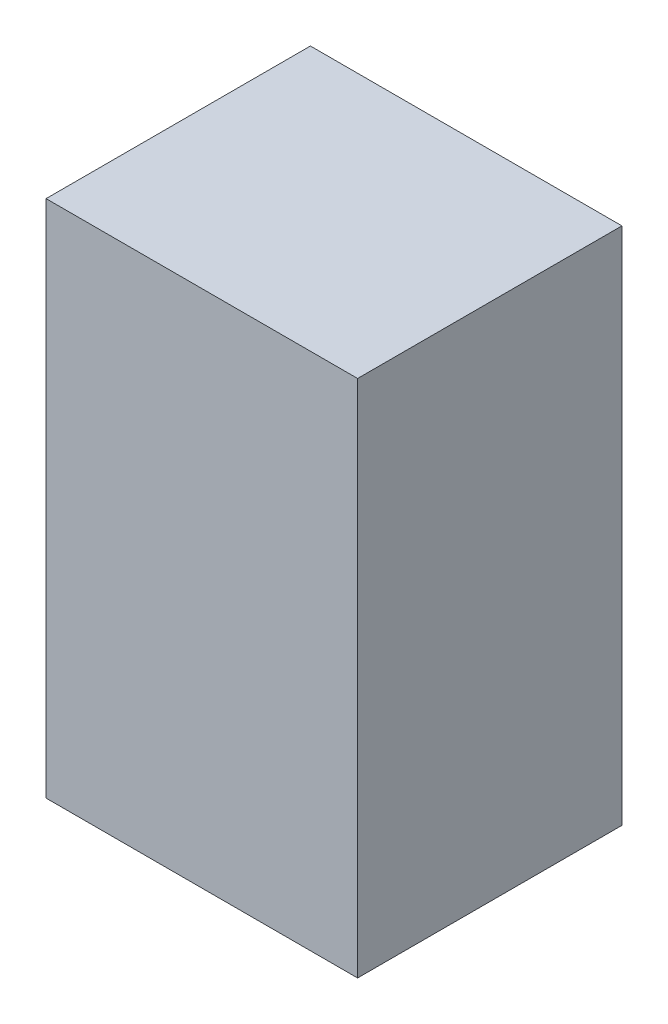
ISO-10303-21;
HEADER;
FILE_DESCRIPTION(('STEP AP214'),'2;1');
FILE_NAME('part.step','',(''),(''),'','','');
FILE_SCHEMA(('AUTOMOTIVE_DESIGN { 1 0 10303 214 1 1 1 1 }'));
ENDSEC;
DATA;
#1=APPLICATION_CONTEXT('core data for automotive mechanical design processes');
#2=APPLICATION_PROTOCOL_DEFINITION('international standard','automotive_design',2000,#1);
#3=PRODUCT_CONTEXT('',#1,'mechanical');
#4=PRODUCT('Part','Part','',(#3));
#5=PRODUCT_RELATED_PRODUCT_CATEGORY('part','',(#4));
#6=PRODUCT_DEFINITION_FORMATION('','',#4);
#7=PRODUCT_DEFINITION_CONTEXT('part definition',#1,'design');
#8=PRODUCT_DEFINITION('design','',#6,#7);
#9=PRODUCT_DEFINITION_SHAPE('','',#8);
#10=(LENGTH_UNIT() NAMED_UNIT(*) SI_UNIT(.MILLI.,.METRE.));
#11=(NAMED_UNIT(*) PLANE_ANGLE_UNIT() SI_UNIT($,.RADIAN.));
#12=(NAMED_UNIT(*) SI_UNIT($,.STERADIAN.) SOLID_ANGLE_UNIT());
#13=UNCERTAINTY_MEASURE_WITH_UNIT(LENGTH_MEASURE(1.E-05),#10,'distance_accuracy_value','');
#14=(GEOMETRIC_REPRESENTATION_CONTEXT(3) GLOBAL_UNCERTAINTY_ASSIGNED_CONTEXT((#13)) GLOBAL_UNIT_ASSIGNED_CONTEXT((#10,
#11,#12)) REPRESENTATION_CONTEXT('',''));
#15=CARTESIAN_POINT('',(0.,0.,0.));
#16=DIRECTION('',(0.,0.,1.));
#17=DIRECTION('',(1.,0.,0.));
#18=AXIS2_PLACEMENT_3D('',#15,#16,#17);
#19=CARTESIAN_POINT('',(-419.1,1397.,-355.6));
#20=DIRECTION('',(1.,0.,0.));
#21=DIRECTION('',(0.,0.,-1.));
#22=AXIS2_PLACEMENT_3D('',#19,#20,#21);
#23=PLANE('',#22);
#24=DIRECTION('',(0.,0.,1.));
#25=VECTOR('',#24,1.);
#26=CARTESIAN_POINT('',(-419.1,0.,-355.6));
#27=LINE('',#26,#25);
#28=CARTESIAN_POINT('',(-419.1,0.,-355.6));
#29=VERTEX_POINT('',#28);
#30=CARTESIAN_POINT('',(-419.1,0.,355.6));
#31=VERTEX_POINT('',#30);
#32=EDGE_CURVE('E95',#29,#31,#27,.T.);
#33=ORIENTED_EDGE('',*,*,#32,.T.);
#34=DIRECTION('',(0.,-1.,0.));
#35=VECTOR('',#34,1.);
#36=CARTESIAN_POINT('',(-419.1,1397.,355.6));
#37=LINE('',#36,#35);
#38=CARTESIAN_POINT('',(-419.1,1397.,355.6));
#39=VERTEX_POINT('',#38);
#40=EDGE_CURVE('E11',#39,#31,#37,.T.);
#41=ORIENTED_EDGE('',*,*,#40,.F.);
#42=DIRECTION('',(0.,0.,1.));
#43=VECTOR('',#42,1.);
#44=CARTESIAN_POINT('',(-419.1,1397.,-355.6));
#45=LINE('',#44,#43);
#46=CARTESIAN_POINT('',(-419.1,1397.,-355.6));
#47=VERTEX_POINT('',#46);
#48=EDGE_CURVE('E83',#47,#39,#45,.T.);
#49=ORIENTED_EDGE('',*,*,#48,.F.);
#50=DIRECTION('',(0.,-1.,0.));
#51=VECTOR('',#50,1.);
#52=CARTESIAN_POINT('',(-419.1,1397.,-355.6));
#53=LINE('',#52,#51);
#54=EDGE_CURVE('E91',#47,#29,#53,.T.);
#55=ORIENTED_EDGE('',*,*,#54,.T.);
#56=EDGE_LOOP('',(#33,#41,#49,#55));
#57=FACE_BOUND('',#56,.T.);
#58=ADVANCED_FACE('F32',(#57),#23,.F.);
#59=CARTESIAN_POINT('',(-419.1,1397.,355.6));
#60=DIRECTION('',(0.,0.,-1.));
#61=DIRECTION('',(-1.,0.,0.));
#62=AXIS2_PLACEMENT_3D('',#59,#60,#61);
#63=PLANE('',#62);
#64=DIRECTION('',(1.,0.,0.));
#65=VECTOR('',#64,1.);
#66=CARTESIAN_POINT('',(-419.1,0.,355.6));
#67=LINE('',#66,#65);
#68=CARTESIAN_POINT('',(419.1,0.,355.6));
#69=VERTEX_POINT('',#68);
#70=EDGE_CURVE('E87',#31,#69,#67,.T.);
#71=ORIENTED_EDGE('',*,*,#70,.T.);
#72=DIRECTION('',(0.,-1.,0.));
#73=VECTOR('',#72,1.);
#74=CARTESIAN_POINT('',(419.1,1397.,355.6));
#75=LINE('',#74,#73);
#76=CARTESIAN_POINT('',(419.1,1397.,355.6));
#77=VERTEX_POINT('',#76);
#78=EDGE_CURVE('E40',#77,#69,#75,.T.);
#79=ORIENTED_EDGE('',*,*,#78,.F.);
#80=DIRECTION('',(1.,0.,0.));
#81=VECTOR('',#80,1.);
#82=CARTESIAN_POINT('',(-419.1,1397.,355.6));
#83=LINE('',#82,#81);
#84=EDGE_CURVE('E78',#39,#77,#83,.T.);
#85=ORIENTED_EDGE('',*,*,#84,.F.);
#86=ORIENTED_EDGE('',*,*,#40,.T.);
#87=EDGE_LOOP('',(#71,#79,#85,#86));
#88=FACE_BOUND('',#87,.T.);
#89=ADVANCED_FACE('F86',(#88),#63,.F.);
#90=CARTESIAN_POINT('',(419.1,1397.,-355.6));
#91=DIRECTION('',(-1.,0.,0.));
#92=DIRECTION('',(0.,0.,1.));
#93=AXIS2_PLACEMENT_3D('',#90,#91,#92);
#94=PLANE('',#93);
#95=DIRECTION('',(0.,0.,-1.));
#96=VECTOR('',#95,1.);
#97=CARTESIAN_POINT('',(419.1,0.,-355.6));
#98=LINE('',#97,#96);
#99=CARTESIAN_POINT('',(419.1,0.,-355.6));
#100=VERTEX_POINT('',#99);
#101=EDGE_CURVE('E65',#69,#100,#98,.T.);
#102=ORIENTED_EDGE('',*,*,#101,.T.);
#103=DIRECTION('',(0.,-1.,0.));
#104=VECTOR('',#103,1.);
#105=CARTESIAN_POINT('',(419.1,1397.,-355.6));
#106=LINE('',#105,#104);
#107=CARTESIAN_POINT('',(419.1,1397.,-355.6));
#108=VERTEX_POINT('',#107);
#109=EDGE_CURVE('E88',#108,#100,#106,.T.);
#110=ORIENTED_EDGE('',*,*,#109,.F.);
#111=DIRECTION('',(0.,0.,-1.));
#112=VECTOR('',#111,1.);
#113=CARTESIAN_POINT('',(419.1,1397.,-355.6));
#114=LINE('',#113,#112);
#115=EDGE_CURVE('E81',#77,#108,#114,.T.);
#116=ORIENTED_EDGE('',*,*,#115,.F.);
#117=ORIENTED_EDGE('',*,*,#78,.T.);
#118=EDGE_LOOP('',(#102,#110,#116,#117));
#119=FACE_BOUND('',#118,.T.);
#120=ADVANCED_FACE('F89',(#119),#94,.F.);
#121=CARTESIAN_POINT('',(-419.1,1397.,-355.6));
#122=DIRECTION('',(0.,0.,1.));
#123=DIRECTION('',(1.,0.,0.));
#124=AXIS2_PLACEMENT_3D('',#121,#122,#123);
#125=PLANE('',#124);
#126=DIRECTION('',(-1.,0.,0.));
#127=VECTOR('',#126,1.);
#128=CARTESIAN_POINT('',(-419.1,0.,-355.6));
#129=LINE('',#128,#127);
#130=EDGE_CURVE('E71',#100,#29,#129,.T.);
#131=ORIENTED_EDGE('',*,*,#130,.T.);
#132=ORIENTED_EDGE('',*,*,#54,.F.);
#133=DIRECTION('',(-1.,0.,0.));
#134=VECTOR('',#133,1.);
#135=CARTESIAN_POINT('',(-419.1,1397.,-355.6));
#136=LINE('',#135,#134);
#137=EDGE_CURVE('E48',#108,#47,#136,.T.);
#138=ORIENTED_EDGE('',*,*,#137,.F.);
#139=ORIENTED_EDGE('',*,*,#109,.T.);
#140=EDGE_LOOP('',(#131,#132,#138,#139));
#141=FACE_BOUND('',#140,.T.);
#142=ADVANCED_FACE('F102',(#141),#125,.F.);
#143=CARTESIAN_POINT('',(0.,1397.,0.));
#144=DIRECTION('',(0.,1.,0.));
#145=DIRECTION('',(0.,0.,1.));
#146=AXIS2_PLACEMENT_3D('',#143,#144,#145);
#147=PLANE('',#146);
#148=ORIENTED_EDGE('',*,*,#48,.T.);
#149=ORIENTED_EDGE('',*,*,#84,.T.);
#150=ORIENTED_EDGE('',*,*,#115,.T.);
#151=ORIENTED_EDGE('',*,*,#137,.T.);
#152=EDGE_LOOP('',(#148,#149,#150,#151));
#153=FACE_BOUND('',#152,.T.);
#154=ADVANCED_FACE('F79',(#153),#147,.T.);
#155=CARTESIAN_POINT('',(0.,0.,0.));
#156=DIRECTION('',(0.,1.,0.));
#157=DIRECTION('',(0.,0.,1.));
#158=AXIS2_PLACEMENT_3D('',#155,#156,#157);
#159=PLANE('',#158);
#160=ORIENTED_EDGE('',*,*,#32,.F.);
#161=ORIENTED_EDGE('',*,*,#130,.F.);
#162=ORIENTED_EDGE('',*,*,#101,.F.);
#163=ORIENTED_EDGE('',*,*,#70,.F.);
#164=EDGE_LOOP('',(#160,#161,#162,#163));
#165=FACE_BOUND('',#164,.T.);
#166=ADVANCED_FACE('F105',(#165),#159,.F.);
#167=CLOSED_SHELL('',(#58,#89,#120,#142,#154,#166));
#168=MANIFOLD_SOLID_BREP('B2',#167);
#169=ADVANCED_BREP_SHAPE_REPRESENTATION('',(#18,#168),#14);
#170=SHAPE_DEFINITION_REPRESENTATION(#9,#169);
ENDSEC;
END-ISO-10303-21;
